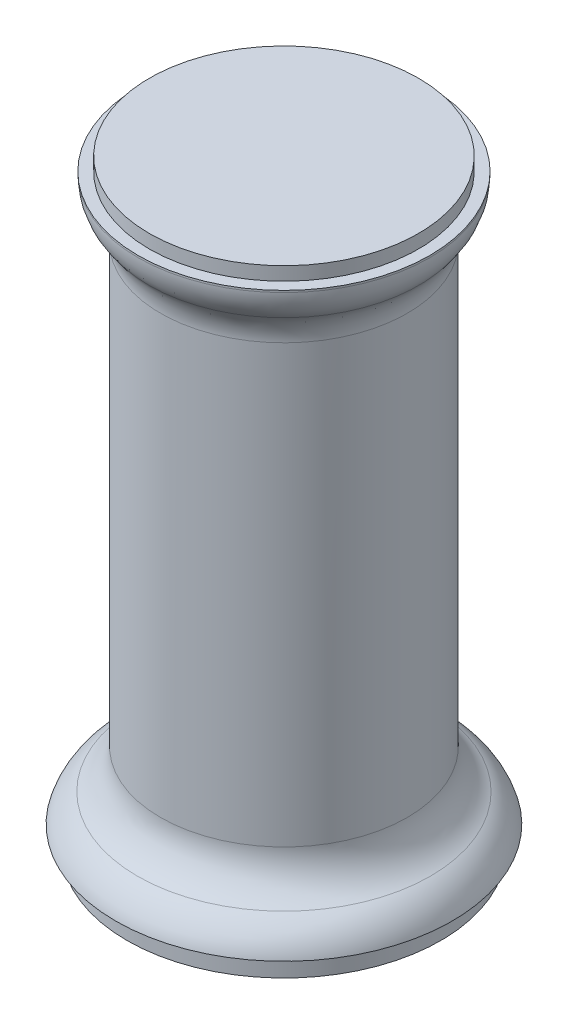
ISO-10303-21;
HEADER;
FILE_DESCRIPTION(('STEP AP214'),'2;1');
FILE_NAME('part.step','',(''),(''),'','','');
FILE_SCHEMA(('AUTOMOTIVE_DESIGN { 1 0 10303 214 1 1 1 1 }'));
ENDSEC;
DATA;
#1=APPLICATION_CONTEXT('core data for automotive mechanical design processes');
#2=APPLICATION_PROTOCOL_DEFINITION('international standard','automotive_design',2000,#1);
#3=PRODUCT_CONTEXT('',#1,'mechanical');
#4=PRODUCT('Part','Part','',(#3));
#5=PRODUCT_RELATED_PRODUCT_CATEGORY('part','',(#4));
#6=PRODUCT_DEFINITION_FORMATION('','',#4);
#7=PRODUCT_DEFINITION_CONTEXT('part definition',#1,'design');
#8=PRODUCT_DEFINITION('design','',#6,#7);
#9=PRODUCT_DEFINITION_SHAPE('','',#8);
#10=(LENGTH_UNIT() NAMED_UNIT(*) SI_UNIT(.MILLI.,.METRE.));
#11=(NAMED_UNIT(*) PLANE_ANGLE_UNIT() SI_UNIT($,.RADIAN.));
#12=(NAMED_UNIT(*) SI_UNIT($,.STERADIAN.) SOLID_ANGLE_UNIT());
#13=UNCERTAINTY_MEASURE_WITH_UNIT(LENGTH_MEASURE(1.E-05),#10,'distance_accuracy_value','');
#14=(GEOMETRIC_REPRESENTATION_CONTEXT(3) GLOBAL_UNCERTAINTY_ASSIGNED_CONTEXT((#13)) GLOBAL_UNIT_ASSIGNED_CONTEXT((#10,
#11,#12)) REPRESENTATION_CONTEXT('',''));
#15=CARTESIAN_POINT('',(0.,0.,0.));
#16=DIRECTION('',(0.,0.,1.));
#17=DIRECTION('',(1.,0.,0.));
#18=AXIS2_PLACEMENT_3D('',#15,#16,#17);
#19=CARTESIAN_POINT('',(0.,5.,0.));
#20=DIRECTION('',(0.,-1.,0.));
#21=DIRECTION('',(0.,0.,-1.));
#22=AXIS2_PLACEMENT_3D('',#19,#20,#21);
#23=CYLINDRICAL_SURFACE('',#22,35.);
#24=CARTESIAN_POINT('',(0.,5.,0.));
#25=DIRECTION('',(0.,1.,0.));
#26=DIRECTION('',(0.,0.,1.));
#27=AXIS2_PLACEMENT_3D('',#24,#25,#26);
#28=CIRCLE('',#27,35.);
#29=CARTESIAN_POINT('',(0.,5.,35.));
#30=VERTEX_POINT('',#29);
#31=EDGE_CURVE('E54',#30,#30,#28,.T.);
#32=ORIENTED_EDGE('',*,*,#31,.F.);
#33=EDGE_LOOP('',(#32));
#34=FACE_BOUND('',#33,.T.);
#35=CARTESIAN_POINT('',(0.,0.,0.));
#36=DIRECTION('',(0.,1.,0.));
#37=DIRECTION('',(0.,0.,1.));
#38=AXIS2_PLACEMENT_3D('',#35,#36,#37);
#39=CIRCLE('',#38,35.);
#40=CARTESIAN_POINT('',(0.,0.,35.));
#41=VERTEX_POINT('',#40);
#42=EDGE_CURVE('E55',#41,#41,#39,.T.);
#43=ORIENTED_EDGE('',*,*,#42,.T.);
#44=EDGE_LOOP('',(#43));
#45=FACE_BOUND('',#44,.T.);
#46=ADVANCED_FACE('F31',(#34,#45),#23,.T.);
#47=CARTESIAN_POINT('',(0.,0.,0.));
#48=DIRECTION('',(0.,1.,0.));
#49=DIRECTION('',(0.,0.,1.));
#50=AXIS2_PLACEMENT_3D('',#47,#48,#49);
#51=PLANE('',#50);
#52=ORIENTED_EDGE('',*,*,#42,.F.);
#53=EDGE_LOOP('',(#52));
#54=FACE_BOUND('',#53,.T.);
#55=ADVANCED_FACE('F98',(#54),#51,.F.);
#56=CARTESIAN_POINT('',(0.,5.,0.));
#57=DIRECTION('',(0.,1.,0.));
#58=DIRECTION('',(0.,0.,1.));
#59=AXIS2_PLACEMENT_3D('',#56,#57,#58);
#60=PLANE('',#59);
#61=ORIENTED_EDGE('',*,*,#31,.T.);
#62=EDGE_LOOP('',(#61));
#63=FACE_BOUND('',#62,.T.);
#64=CARTESIAN_POINT('',(0.,5.,0.));
#65=DIRECTION('',(0.,1.,0.));
#66=DIRECTION('',(0.,0.,1.));
#67=AXIS2_PLACEMENT_3D('',#64,#65,#66);
#68=CIRCLE('',#67,37.5);
#69=CARTESIAN_POINT('',(0.,5.,37.5));
#70=VERTEX_POINT('',#69);
#71=EDGE_CURVE('E58',#70,#70,#68,.T.);
#72=ORIENTED_EDGE('',*,*,#71,.F.);
#73=EDGE_LOOP('',(#72));
#74=FACE_BOUND('',#73,.T.);
#75=ADVANCED_FACE('F94',(#63,#74),#60,.F.);
#76=CARTESIAN_POINT('',(0.,126.,0.));
#77=DIRECTION('',(0.,-1.,0.));
#78=DIRECTION('',(0.,0.,-1.));
#79=AXIS2_PLACEMENT_3D('',#76,#77,#78);
#80=CYLINDRICAL_SURFACE('',#79,27.5);
#81=CARTESIAN_POINT('',(0.,117.339745962156,0.));
#82=DIRECTION('',(0.,1.,0.));
#83=DIRECTION('',(0.,0.,1.));
#84=AXIS2_PLACEMENT_3D('',#81,#82,#83);
#85=CIRCLE('',#84,27.5);
#86=CARTESIAN_POINT('',(0.,117.339745962156,-27.5));
#87=VERTEX_POINT('',#86);
#88=EDGE_CURVE('E46',#87,#87,#85,.F.);
#89=CARTESIAN_POINT('',(0.,20.,0.));
#90=DIRECTION('',(0.,1.,0.));
#91=DIRECTION('',(0.,0.,1.));
#92=AXIS2_PLACEMENT_3D('',#89,#90,#91);
#93=CIRCLE('',#92,27.5);
#94=CARTESIAN_POINT('',(0.,20.,-27.5));
#95=VERTEX_POINT('',#94);
#96=EDGE_CURVE('E51',#95,#95,#93,.T.);
#97=CARTESIAN_POINT('',(0.,117.339745962156,-27.5));
#98=CARTESIAN_POINT('',(0.,116.32579027505,-27.5));
#99=CARTESIAN_POINT('',(0.,115.311834587944,-27.5));
#100=CARTESIAN_POINT('',(0.,113.283923213732,-27.5));
#101=CARTESIAN_POINT('',(0.,112.269967526627,-27.5));
#102=CARTESIAN_POINT('',(0.,110.242056152415,-27.5));
#103=CARTESIAN_POINT('',(0.,109.228100465309,-27.5));
#104=CARTESIAN_POINT('',(0.,107.200189091098,-27.5));
#105=CARTESIAN_POINT('',(0.,106.186233403992,-27.5));
#106=CARTESIAN_POINT('',(0.,104.15832202978,-27.5));
#107=CARTESIAN_POINT('',(0.,103.144366342675,-27.5));
#108=CARTESIAN_POINT('',(0.,101.116454968463,-27.5));
#109=CARTESIAN_POINT('',(0.,100.102499281357,-27.5));
#110=CARTESIAN_POINT('',(0.,98.0745879071456,-27.5));
#111=CARTESIAN_POINT('',(0.,97.0606322200398,-27.5));
#112=CARTESIAN_POINT('',(0.,95.0327208458283,-27.5));
#113=CARTESIAN_POINT('',(0.,94.0187651587225,-27.5));
#114=CARTESIAN_POINT('',(0.,91.9908537845109,-27.5));
#115=CARTESIAN_POINT('',(0.,90.9768980974051,-27.5));
#116=CARTESIAN_POINT('',(0.,88.9489867231936,-27.5));
#117=CARTESIAN_POINT('',(0.,87.9350310360878,-27.5));
#118=CARTESIAN_POINT('',(0.,85.9071196618762,-27.5));
#119=CARTESIAN_POINT('',(0.,84.8931639747704,-27.5));
#120=CARTESIAN_POINT('',(0.,82.8652526005588,-27.5));
#121=CARTESIAN_POINT('',(0.,81.851296913453,-27.5));
#122=CARTESIAN_POINT('',(0.,79.8233855392415,-27.5));
#123=CARTESIAN_POINT('',(0.,78.8094298521357,-27.5));
#124=CARTESIAN_POINT('',(0.,76.7815184779241,-27.5));
#125=CARTESIAN_POINT('',(0.,75.7675627908183,-27.5));
#126=CARTESIAN_POINT('',(0.,73.7396514166067,-27.5));
#127=CARTESIAN_POINT('',(0.,72.725695729501,-27.5));
#128=CARTESIAN_POINT('',(0.,70.6977843552894,-27.5));
#129=CARTESIAN_POINT('',(0.,69.6838286681836,-27.5));
#130=CARTESIAN_POINT('',(0.,67.655917293972,-27.5));
#131=CARTESIAN_POINT('',(0.,66.6419616068662,-27.5));
#132=CARTESIAN_POINT('',(0.,64.6140502326547,-27.5));
#133=CARTESIAN_POINT('',(0.,63.6000945455489,-27.5));
#134=CARTESIAN_POINT('',(0.,61.5721831713373,-27.5));
#135=CARTESIAN_POINT('',(0.,60.5582274842315,-27.5));
#136=CARTESIAN_POINT('',(0.,58.5303161100199,-27.5));
#137=CARTESIAN_POINT('',(0.,57.5163604229142,-27.5));
#138=CARTESIAN_POINT('',(0.,55.4884490487026,-27.5));
#139=CARTESIAN_POINT('',(0.,54.4744933615968,-27.5));
#140=CARTESIAN_POINT('',(0.,52.4465819873852,-27.5));
#141=CARTESIAN_POINT('',(0.,51.4326263002794,-27.5));
#142=CARTESIAN_POINT('',(0.,49.4047149260678,-27.5));
#143=CARTESIAN_POINT('',(0.,48.3907592389621,-27.5));
#144=CARTESIAN_POINT('',(0.,46.3628478647505,-27.5));
#145=CARTESIAN_POINT('',(0.,45.3488921776447,-27.5));
#146=CARTESIAN_POINT('',(0.,43.3209808034331,-27.5));
#147=CARTESIAN_POINT('',(0.,42.3070251163273,-27.5));
#148=CARTESIAN_POINT('',(0.,40.2791137421158,-27.5));
#149=CARTESIAN_POINT('',(0.,39.26515805501,-27.5));
#150=CARTESIAN_POINT('',(0.,37.2372466807984,-27.5));
#151=CARTESIAN_POINT('',(0.,36.2232909936926,-27.5));
#152=CARTESIAN_POINT('',(0.,34.195379619481,-27.5));
#153=CARTESIAN_POINT('',(0.,33.1814239323753,-27.5));
#154=CARTESIAN_POINT('',(0.,31.1535125581637,-27.5));
#155=CARTESIAN_POINT('',(0.,30.1395568710579,-27.5));
#156=CARTESIAN_POINT('',(0.,28.1116454968463,-27.5));
#157=CARTESIAN_POINT('',(0.,27.0976898097405,-27.5));
#158=CARTESIAN_POINT('',(0.,25.069778435529,-27.5));
#159=CARTESIAN_POINT('',(0.,24.0558227484232,-27.5));
#160=CARTESIAN_POINT('',(0.,22.0279113742116,-27.5));
#161=CARTESIAN_POINT('',(0.,21.0139556871058,-27.5));
#162=CARTESIAN_POINT('',(0.,20.,-27.5));
#163=B_SPLINE_CURVE_WITH_KNOTS('',3,(#97,#98,#99,#100,#101,#102,#103,#104,#105,#106,#107,#108,
#109,#110,#111,#112,#113,#114,#115,#116,#117,#118,#119,#120,#121,#122,#123,#124,#125,#126,#127,
#128,#129,#130,#131,#132,#133,#134,#135,#136,#137,#138,#139,#140,#141,#142,#143,#144,#145,#146,
#147,#148,#149,#150,#151,#152,#153,#154,#155,#156,#157,#158,#159,#160,#161,#162),.UNSPECIFIED.,
.F.,.F.,(4,2,2,2,2,2,2,2,2,2,2,2,2,2,2,2,2,2,2,2,2,2,2,2,2,2,2,2,2,2,2,2,4),(0.,
3.04186706131737,6.08373412263473,9.12560118395209,12.1674682452695,15.2093353065868,
18.2512023679042,21.2930694292215,24.3349364905389,27.3768035518563,30.4186706131736,
33.460537674491,36.5024047358084,39.5442717971257,42.5861388584431,45.6280059197604,
48.6698729810778,51.7117400423952,54.7536071037125,57.7954741650299,60.8373412263472,
63.8792082876646,66.921075348982,69.9629424102993,73.0048094716167,76.0466765329341,
79.0885435942514,82.1304106555688,85.1722777168862,88.2141447782035,91.2560118395209,
94.2978789008382,97.3397459621556),.UNSPECIFIED.);
#164=EDGE_CURVE('BSEAM89',#87,#95,#163,.T.);
#165=ORIENTED_EDGE('',*,*,#88,.T.);
#166=ORIENTED_EDGE('',*,*,#96,.T.);
#167=ORIENTED_EDGE('',*,*,#164,.T.);
#168=ORIENTED_EDGE('',*,*,#164,.F.);
#169=EDGE_LOOP('',(#165,#167,#166,#168));
#170=FACE_BOUND('',#169,.T.);
#171=ADVANCED_FACE('F89',(#170),#80,.T.);
#172=CARTESIAN_POINT('',(0.,131.,0.));
#173=DIRECTION('',(0.,-1.,0.));
#174=DIRECTION('',(0.,0.,-1.));
#175=AXIS2_PLACEMENT_3D('',#172,#173,#174);
#176=CYLINDRICAL_SURFACE('',#175,32.5);
#177=CARTESIAN_POINT('',(0.,130.568502517479,0.));
#178=DIRECTION('',(0.,-1.,0.));
#179=DIRECTION('',(0.,0.,-1.));
#180=AXIS2_PLACEMENT_3D('',#177,#178,#179);
#181=CIRCLE('',#180,32.5);
#182=CARTESIAN_POINT('',(0.,130.568502517479,-32.5));
#183=VERTEX_POINT('',#182);
#184=EDGE_CURVE('E38',#183,#183,#181,.F.);
#185=ORIENTED_EDGE('',*,*,#184,.T.);
#186=EDGE_LOOP('',(#185));
#187=FACE_BOUND('',#186,.T.);
#188=CARTESIAN_POINT('',(0.,131.,0.));
#189=DIRECTION('',(0.,1.,0.));
#190=DIRECTION('',(0.,0.,1.));
#191=AXIS2_PLACEMENT_3D('',#188,#189,#190);
#192=CIRCLE('',#191,32.5);
#193=CARTESIAN_POINT('',(0.,131.,32.5));
#194=VERTEX_POINT('',#193);
#195=EDGE_CURVE('E63',#194,#194,#192,.T.);
#196=ORIENTED_EDGE('',*,*,#195,.F.);
#197=EDGE_LOOP('',(#196));
#198=FACE_BOUND('',#197,.T.);
#199=ADVANCED_FACE('F84',(#187,#198),#176,.T.);
#200=CARTESIAN_POINT('',(0.,131.,0.));
#201=DIRECTION('',(0.,1.,0.));
#202=DIRECTION('',(0.,0.,1.));
#203=AXIS2_PLACEMENT_3D('',#200,#201,#202);
#204=PLANE('',#203);
#205=CARTESIAN_POINT('',(0.,131.,0.));
#206=DIRECTION('',(0.,1.,0.));
#207=DIRECTION('',(0.,0.,1.));
#208=AXIS2_PLACEMENT_3D('',#205,#206,#207);
#209=CIRCLE('',#208,30.);
#210=CARTESIAN_POINT('',(0.,131.,30.));
#211=VERTEX_POINT('',#210);
#212=EDGE_CURVE('E67',#211,#211,#209,.T.);
#213=ORIENTED_EDGE('',*,*,#212,.F.);
#214=EDGE_LOOP('',(#213));
#215=FACE_BOUND('',#214,.T.);
#216=ORIENTED_EDGE('',*,*,#195,.T.);
#217=EDGE_LOOP('',(#216));
#218=FACE_BOUND('',#217,.T.);
#219=ADVANCED_FACE('F78',(#215,#218),#204,.T.);
#220=CARTESIAN_POINT('',(0.,134.,0.));
#221=DIRECTION('',(0.,-1.,0.));
#222=DIRECTION('',(0.,0.,-1.));
#223=AXIS2_PLACEMENT_3D('',#220,#221,#222);
#224=CYLINDRICAL_SURFACE('',#223,30.);
#225=CARTESIAN_POINT('',(0.,134.,0.));
#226=DIRECTION('',(0.,1.,0.));
#227=DIRECTION('',(0.,0.,1.));
#228=AXIS2_PLACEMENT_3D('',#225,#226,#227);
#229=CIRCLE('',#228,30.);
#230=CARTESIAN_POINT('',(0.,134.,30.));
#231=VERTEX_POINT('',#230);
#232=EDGE_CURVE('E66',#231,#231,#229,.T.);
#233=ORIENTED_EDGE('',*,*,#232,.F.);
#234=EDGE_LOOP('',(#233));
#235=FACE_BOUND('',#234,.T.);
#236=ORIENTED_EDGE('',*,*,#212,.T.);
#237=EDGE_LOOP('',(#236));
#238=FACE_BOUND('',#237,.T.);
#239=ADVANCED_FACE('F75',(#235,#238),#224,.T.);
#240=CARTESIAN_POINT('',(0.,134.,0.));
#241=DIRECTION('',(0.,1.,0.));
#242=DIRECTION('',(0.,0.,1.));
#243=AXIS2_PLACEMENT_3D('',#240,#241,#242);
#244=PLANE('',#243);
#245=ORIENTED_EDGE('',*,*,#232,.T.);
#246=EDGE_LOOP('',(#245));
#247=FACE_BOUND('',#246,.T.);
#248=ADVANCED_FACE('F73',(#247),#244,.T.);
#249=CARTESIAN_POINT('',(0.,117.339745962156,0.));
#250=DIRECTION('',(0.,1.,0.));
#251=DIRECTION('',(0.,0.,1.));
#252=AXIS2_PLACEMENT_3D('',#249,#250,#251);
#253=TOROIDAL_SURFACE('',#252,37.5,10.);
#254=CARTESIAN_POINT('',(0.,123.954124239817,0.));
#255=DIRECTION('',(0.,-1.,0.));
#256=DIRECTION('',(0.,0.,-1.));
#257=AXIS2_PLACEMENT_3D('',#254,#255,#256);
#258=CIRCLE('',#257,30.);
#259=CARTESIAN_POINT('',(0.,123.954124239817,-30.));
#260=VERTEX_POINT('',#259);
#261=EDGE_CURVE('E10',#260,#260,#258,.T.);
#262=ORIENTED_EDGE('',*,*,#261,.T.);
#263=EDGE_LOOP('',(#262));
#264=FACE_BOUND('',#263,.T.);
#265=ORIENTED_EDGE('',*,*,#88,.F.);
#266=EDGE_LOOP('',(#265));
#267=FACE_BOUND('',#266,.T.);
#268=ADVANCED_FACE('F110',(#264,#267),#253,.F.);
#269=CARTESIAN_POINT('',(0.,20.,0.));
#270=DIRECTION('',(0.,1.,0.));
#271=DIRECTION('',(0.,0.,1.));
#272=AXIS2_PLACEMENT_3D('',#269,#270,#271);
#273=TOROIDAL_SURFACE('',#272,37.5,10.);
#274=CARTESIAN_POINT('',(0.,11.2499999999999,0.));
#275=DIRECTION('',(0.,1.,0.));
#276=DIRECTION('',(0.,0.,1.));
#277=AXIS2_PLACEMENT_3D('',#274,#275,#276);
#278=CIRCLE('',#277,32.6587708172407);
#279=CARTESIAN_POINT('',(0.,11.2499999999999,32.6587708172407));
#280=VERTEX_POINT('',#279);
#281=EDGE_CURVE('E42',#280,#280,#278,.T.);
#282=ORIENTED_EDGE('',*,*,#281,.T.);
#283=EDGE_LOOP('',(#282));
#284=FACE_BOUND('',#283,.T.);
#285=ORIENTED_EDGE('',*,*,#96,.F.);
#286=EDGE_LOOP('',(#285));
#287=FACE_BOUND('',#286,.T.);
#288=ADVANCED_FACE('F113',(#284,#287),#273,.F.);
#289=CARTESIAN_POINT('',(0.,2.5,0.));
#290=DIRECTION('',(0.,1.,0.));
#291=DIRECTION('',(0.,0.,1.));
#292=AXIS2_PLACEMENT_3D('',#289,#290,#291);
#293=TOROIDAL_SURFACE('',#292,27.8175416344815,10.);
#294=ORIENTED_EDGE('',*,*,#71,.T.);
#295=EDGE_LOOP('',(#294));
#296=FACE_BOUND('',#295,.T.);
#297=ORIENTED_EDGE('',*,*,#281,.F.);
#298=EDGE_LOOP('',(#297));
#299=FACE_BOUND('',#298,.T.);
#300=ADVANCED_FACE('F115',(#296,#299),#293,.T.);
#301=CARTESIAN_POINT('',(0.,130.568502517479,0.));
#302=DIRECTION('',(0.,-1.,0.));
#303=DIRECTION('',(0.,0.,-1.));
#304=AXIS2_PLACEMENT_3D('',#301,#302,#303);
#305=TOROIDAL_SURFACE('',#304,22.5,10.);
#306=ORIENTED_EDGE('',*,*,#261,.F.);
#307=EDGE_LOOP('',(#306));
#308=FACE_BOUND('',#307,.T.);
#309=ORIENTED_EDGE('',*,*,#184,.F.);
#310=EDGE_LOOP('',(#309));
#311=FACE_BOUND('',#310,.T.);
#312=ADVANCED_FACE('F33',(#308,#311),#305,.T.);
#313=CLOSED_SHELL('',(#46,#55,#75,#171,#199,#219,#239,#248,#268,#288,#300,#312));
#314=MANIFOLD_SOLID_BREP('B2',#313);
#315=ADVANCED_BREP_SHAPE_REPRESENTATION('',(#18,#314),#14);
#316=SHAPE_DEFINITION_REPRESENTATION(#9,#315);
ENDSEC;
END-ISO-10303-21;
